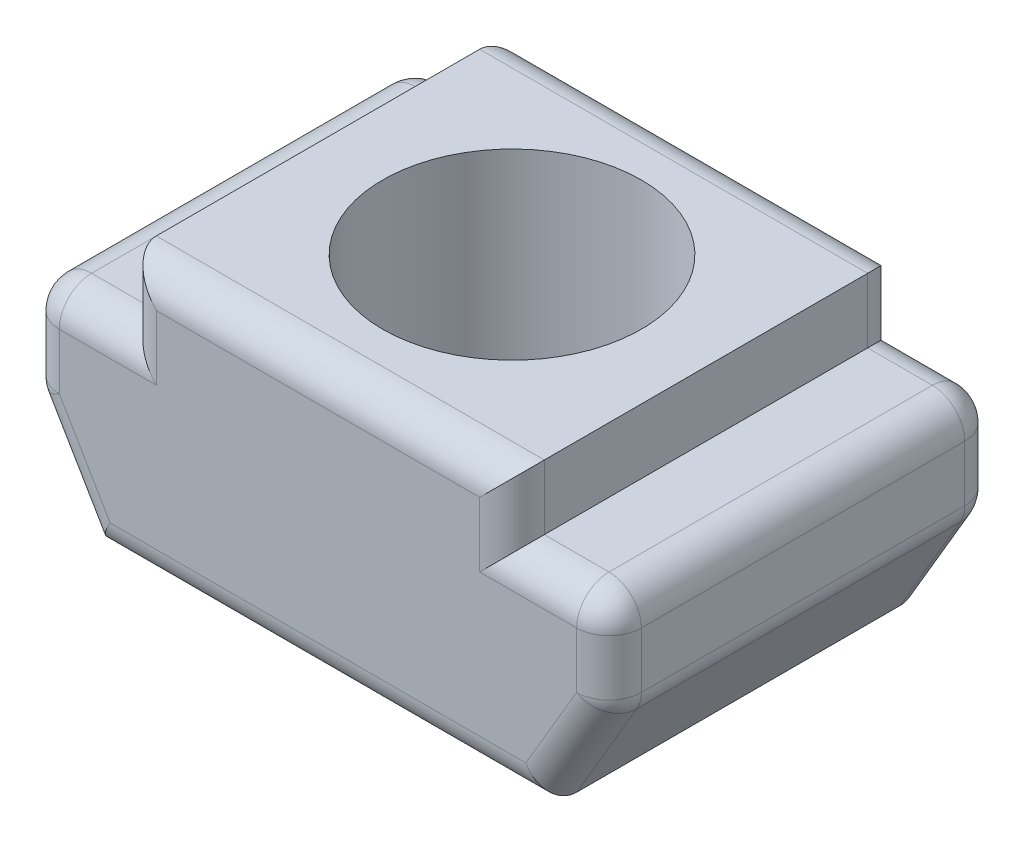
ISO-10303-21;
HEADER;
FILE_DESCRIPTION(('STEP AP214'),'2;1');
FILE_NAME('part.step','',(''),(''),'','','');
FILE_SCHEMA(('AUTOMOTIVE_DESIGN { 1 0 10303 214 1 1 1 1 }'));
ENDSEC;
DATA;
#1=APPLICATION_CONTEXT('core data for automotive mechanical design processes');
#2=APPLICATION_PROTOCOL_DEFINITION('international standard','automotive_design',2000,#1);
#3=PRODUCT_CONTEXT('',#1,'mechanical');
#4=PRODUCT('Part','Part','',(#3));
#5=PRODUCT_RELATED_PRODUCT_CATEGORY('part','',(#4));
#6=PRODUCT_DEFINITION_FORMATION('','',#4);
#7=PRODUCT_DEFINITION_CONTEXT('part definition',#1,'design');
#8=PRODUCT_DEFINITION('design','',#6,#7);
#9=PRODUCT_DEFINITION_SHAPE('','',#8);
#10=(LENGTH_UNIT() NAMED_UNIT(*) SI_UNIT(.MILLI.,.METRE.));
#11=(NAMED_UNIT(*) PLANE_ANGLE_UNIT() SI_UNIT($,.RADIAN.));
#12=(NAMED_UNIT(*) SI_UNIT($,.STERADIAN.) SOLID_ANGLE_UNIT());
#13=UNCERTAINTY_MEASURE_WITH_UNIT(LENGTH_MEASURE(1.E-05),#10,'distance_accuracy_value','');
#14=(GEOMETRIC_REPRESENTATION_CONTEXT(3) GLOBAL_UNCERTAINTY_ASSIGNED_CONTEXT((#13)) GLOBAL_UNIT_ASSIGNED_CONTEXT((#10,
#11,#12)) REPRESENTATION_CONTEXT('',''));
#15=CARTESIAN_POINT('',(0.,0.,0.));
#16=DIRECTION('',(0.,0.,1.));
#17=DIRECTION('',(1.,0.,0.));
#18=AXIS2_PLACEMENT_3D('',#15,#16,#17);
#19=CARTESIAN_POINT('',(0.,0.,6.));
#20=DIRECTION('',(0.,1.,0.));
#21=DIRECTION('',(-1.,0.,0.));
#22=AXIS2_PLACEMENT_3D('',#19,#20,#21);
#23=PLANE('',#22);
#24=DIRECTION('',(0.,0.,-1.));
#25=VECTOR('',#24,1.);
#26=CARTESIAN_POINT('',(4.,0.,6.));
#27=LINE('',#26,#25);
#28=CARTESIAN_POINT('',(4.,0.,5.5));
#29=VERTEX_POINT('',#28);
#30=CARTESIAN_POINT('',(4.,0.,0.5));
#31=VERTEX_POINT('',#30);
#32=EDGE_CURVE('E296',#29,#31,#27,.T.);
#33=ORIENTED_EDGE('',*,*,#32,.T.);
#34=DIRECTION('',(1.,0.,0.));
#35=VECTOR('',#34,1.);
#36=CARTESIAN_POINT('',(3.,0.,0.5));
#37=LINE('',#36,#35);
#38=CARTESIAN_POINT('',(3.,0.,0.5));
#39=VERTEX_POINT('',#38);
#40=EDGE_CURVE('E299',#31,#39,#37,.F.);
#41=ORIENTED_EDGE('',*,*,#40,.T.);
#42=DIRECTION('',(0.,0.,1.));
#43=VECTOR('',#42,1.);
#44=CARTESIAN_POINT('',(3.,0.,0.));
#45=LINE('',#44,#43);
#46=CARTESIAN_POINT('',(3.,0.,5.5));
#47=VERTEX_POINT('',#46);
#48=EDGE_CURVE('E523',#39,#47,#45,.T.);
#49=ORIENTED_EDGE('',*,*,#48,.T.);
#50=DIRECTION('',(1.,0.,0.));
#51=VECTOR('',#50,1.);
#52=CARTESIAN_POINT('',(0.,0.,5.5));
#53=LINE('',#52,#51);
#54=EDGE_CURVE('E293',#47,#29,#53,.T.);
#55=ORIENTED_EDGE('',*,*,#54,.T.);
#56=EDGE_LOOP('',(#33,#41,#49,#55));
#57=FACE_BOUND('',#56,.T.);
#58=ADVANCED_FACE('F41',(#57),#23,.T.);
#59=CARTESIAN_POINT('',(-4.5,0.,6.));
#60=DIRECTION('',(1.,0.,0.));
#61=DIRECTION('',(0.,1.,0.));
#62=AXIS2_PLACEMENT_3D('',#59,#60,#61);
#63=PLANE('',#62);
#64=DIRECTION('',(0.,0.,-1.));
#65=VECTOR('',#64,1.);
#66=CARTESIAN_POINT('',(-4.5,-0.5,0.));
#67=LINE('',#66,#65);
#68=CARTESIAN_POINT('',(-4.5,-0.5,5.5));
#69=VERTEX_POINT('',#68);
#70=CARTESIAN_POINT('',(-4.5,-0.5,0.5));
#71=VERTEX_POINT('',#70);
#72=EDGE_CURVE('E336',#69,#71,#67,.T.);
#73=ORIENTED_EDGE('',*,*,#72,.T.);
#74=DIRECTION('',(0.,-1.,0.));
#75=VECTOR('',#74,1.);
#76=CARTESIAN_POINT('',(-4.5,0.,0.5));
#77=LINE('',#76,#75);
#78=CARTESIAN_POINT('',(-4.5,-1.3638458538342,0.5));
#79=VERTEX_POINT('',#78);
#80=EDGE_CURVE('E340',#71,#79,#77,.T.);
#81=ORIENTED_EDGE('',*,*,#80,.T.);
#82=DIRECTION('',(0.,0.,-1.));
#83=VECTOR('',#82,1.);
#84=CARTESIAN_POINT('',(-4.5,-1.3638458538342,6.));
#85=LINE('',#84,#83);
#86=CARTESIAN_POINT('',(-4.5,-1.3638458538342,5.5));
#87=VERTEX_POINT('',#86);
#88=EDGE_CURVE('E333',#79,#87,#85,.F.);
#89=ORIENTED_EDGE('',*,*,#88,.T.);
#90=DIRECTION('',(0.,-1.,0.));
#91=VECTOR('',#90,1.);
#92=CARTESIAN_POINT('',(-4.5,0.,5.5));
#93=LINE('',#92,#91);
#94=EDGE_CURVE('E330',#87,#69,#93,.F.);
#95=ORIENTED_EDGE('',*,*,#94,.T.);
#96=EDGE_LOOP('',(#73,#81,#89,#95));
#97=FACE_BOUND('',#96,.T.);
#98=ADVANCED_FACE('F585',(#97),#63,.F.);
#99=CARTESIAN_POINT('',(-3.9987146529563,-2.35218508997429,6.));
#100=DIRECTION('',(0.86193421515777,0.507020126563393,0.));
#101=DIRECTION('',(-0.507020126563394,0.86193421515777,0.));
#102=AXIS2_PLACEMENT_3D('',#99,#100,#101);
#103=PLANE('',#102);
#104=DIRECTION('',(0.,0.,-1.));
#105=VECTOR('',#104,1.);
#106=CARTESIAN_POINT('',(-4.43096710757888,-1.6173559171159,6.));
#107=LINE('',#106,#105);
#108=CARTESIAN_POINT('',(-4.43096710757888,-1.6173559171159,5.5));
#109=VERTEX_POINT('',#108);
#110=CARTESIAN_POINT('',(-4.43096710757888,-1.6173559171159,0.5));
#111=VERTEX_POINT('',#110);
#112=EDGE_CURVE('E244',#109,#111,#107,.T.);
#113=ORIENTED_EDGE('',*,*,#112,.T.);
#114=DIRECTION('',(0.507020126563394,-0.86193421515777,0.));
#115=VECTOR('',#114,1.);
#116=CARTESIAN_POINT('',(-3.9987146529563,-2.35218508997429,0.5));
#117=LINE('',#116,#115);
#118=CARTESIAN_POINT('',(-3.5,-3.2,0.5));
#119=VERTEX_POINT('',#118);
#120=EDGE_CURVE('E225',#111,#119,#117,.T.);
#121=ORIENTED_EDGE('',*,*,#120,.T.);
#122=DIRECTION('',(0.,0.,-1.));
#123=VECTOR('',#122,1.);
#124=CARTESIAN_POINT('',(-3.5,-3.2,6.));
#125=LINE('',#124,#123);
#126=CARTESIAN_POINT('',(-3.5,-3.2,5.5));
#127=VERTEX_POINT('',#126);
#128=EDGE_CURVE('E207',#127,#119,#125,.T.);
#129=ORIENTED_EDGE('',*,*,#128,.F.);
#130=DIRECTION('',(0.507020126563394,-0.86193421515777,0.));
#131=VECTOR('',#130,1.);
#132=CARTESIAN_POINT('',(-4.5,-1.5,5.5));
#133=LINE('',#132,#131);
#134=EDGE_CURVE('E222',#127,#109,#133,.F.);
#135=ORIENTED_EDGE('',*,*,#134,.T.);
#136=EDGE_LOOP('',(#113,#121,#129,#135));
#137=FACE_BOUND('',#136,.T.);
#138=ADVANCED_FACE('F220',(#137),#103,.F.);
#139=CARTESIAN_POINT('',(0.,-3.2,6.));
#140=DIRECTION('',(0.,1.,0.));
#141=DIRECTION('',(-1.,0.,0.));
#142=AXIS2_PLACEMENT_3D('',#139,#140,#141);
#143=PLANE('',#142);
#144=CARTESIAN_POINT('',(0.,-3.2,3.));
#145=DIRECTION('',(0.,1.,0.));
#146=DIRECTION('',(0.,0.,1.));
#147=AXIS2_PLACEMENT_3D('',#144,#145,#146);
#148=CIRCLE('',#147,2.);
#149=CARTESIAN_POINT('',(0.,-3.2,5.));
#150=VERTEX_POINT('',#149);
#151=EDGE_CURVE('E517',#150,#150,#148,.T.);
#152=ORIENTED_EDGE('',*,*,#151,.T.);
#153=EDGE_LOOP('',(#152));
#154=FACE_BOUND('',#153,.T.);
#155=ORIENTED_EDGE('',*,*,#128,.T.);
#156=DIRECTION('',(1.,0.,0.));
#157=VECTOR('',#156,1.);
#158=CARTESIAN_POINT('',(0.,-3.2,0.5));
#159=LINE('',#158,#157);
#160=CARTESIAN_POINT('',(3.5,-3.2,0.5));
#161=VERTEX_POINT('',#160);
#162=EDGE_CURVE('E215',#119,#161,#159,.T.);
#163=ORIENTED_EDGE('',*,*,#162,.T.);
#164=DIRECTION('',(0.,0.,-1.));
#165=VECTOR('',#164,1.);
#166=CARTESIAN_POINT('',(3.5,-3.2,6.));
#167=LINE('',#166,#165);
#168=CARTESIAN_POINT('',(3.5,-3.2,5.5));
#169=VERTEX_POINT('',#168);
#170=EDGE_CURVE('E209',#169,#161,#167,.T.);
#171=ORIENTED_EDGE('',*,*,#170,.F.);
#172=DIRECTION('',(1.,0.,0.));
#173=VECTOR('',#172,1.);
#174=CARTESIAN_POINT('',(-3.5,-3.2,5.5));
#175=LINE('',#174,#173);
#176=EDGE_CURVE('E204',#169,#127,#175,.F.);
#177=ORIENTED_EDGE('',*,*,#176,.T.);
#178=EDGE_LOOP('',(#155,#163,#171,#177));
#179=FACE_BOUND('',#178,.T.);
#180=ADVANCED_FACE('F206',(#154,#179),#143,.F.);
#181=CARTESIAN_POINT('',(3.9987146529563,-2.35218508997429,6.));
#182=DIRECTION('',(0.86193421515777,-0.507020126563393,0.));
#183=DIRECTION('',(0.507020126563393,0.86193421515777,0.));
#184=AXIS2_PLACEMENT_3D('',#181,#182,#183);
#185=PLANE('',#184);
#186=ORIENTED_EDGE('',*,*,#170,.T.);
#187=DIRECTION('',(-0.507020126563393,-0.86193421515777,0.));
#188=VECTOR('',#187,1.);
#189=CARTESIAN_POINT('',(4.5,-1.5,0.5));
#190=LINE('',#189,#188);
#191=CARTESIAN_POINT('',(4.43096710757888,-1.6173559171159,0.5));
#192=VERTEX_POINT('',#191);
#193=EDGE_CURVE('E290',#161,#192,#190,.F.);
#194=ORIENTED_EDGE('',*,*,#193,.T.);
#195=DIRECTION('',(0.,0.,-1.));
#196=VECTOR('',#195,1.);
#197=CARTESIAN_POINT('',(4.43096710757888,-1.6173559171159,6.));
#198=LINE('',#197,#196);
#199=CARTESIAN_POINT('',(4.43096710757888,-1.6173559171159,5.5));
#200=VERTEX_POINT('',#199);
#201=EDGE_CURVE('E287',#192,#200,#198,.F.);
#202=ORIENTED_EDGE('',*,*,#201,.T.);
#203=DIRECTION('',(-0.507020126563393,-0.86193421515777,0.));
#204=VECTOR('',#203,1.);
#205=CARTESIAN_POINT('',(3.9987146529563,-2.35218508997429,5.5));
#206=LINE('',#205,#204);
#207=EDGE_CURVE('E284',#200,#169,#206,.T.);
#208=ORIENTED_EDGE('',*,*,#207,.T.);
#209=EDGE_LOOP('',(#186,#194,#202,#208));
#210=FACE_BOUND('',#209,.T.);
#211=ADVANCED_FACE('F543',(#210),#185,.T.);
#212=CARTESIAN_POINT('',(4.5,0.,6.));
#213=DIRECTION('',(1.,0.,0.));
#214=DIRECTION('',(0.,1.,0.));
#215=AXIS2_PLACEMENT_3D('',#212,#213,#214);
#216=PLANE('',#215);
#217=DIRECTION('',(0.,0.,-1.));
#218=VECTOR('',#217,1.);
#219=CARTESIAN_POINT('',(4.5,-1.3638458538342,6.));
#220=LINE('',#219,#218);
#221=CARTESIAN_POINT('',(4.5,-1.3638458538342,5.5));
#222=VERTEX_POINT('',#221);
#223=CARTESIAN_POINT('',(4.5,-1.3638458538342,0.5));
#224=VERTEX_POINT('',#223);
#225=EDGE_CURVE('E349',#222,#224,#220,.T.);
#226=ORIENTED_EDGE('',*,*,#225,.T.);
#227=DIRECTION('',(0.,-1.,0.));
#228=VECTOR('',#227,1.);
#229=CARTESIAN_POINT('',(4.5,0.,0.5));
#230=LINE('',#229,#228);
#231=CARTESIAN_POINT('',(4.5,-0.499999999999999,0.5));
#232=VERTEX_POINT('',#231);
#233=EDGE_CURVE('E353',#224,#232,#230,.F.);
#234=ORIENTED_EDGE('',*,*,#233,.T.);
#235=DIRECTION('',(0.,0.,-1.));
#236=VECTOR('',#235,1.);
#237=CARTESIAN_POINT('',(4.5,-0.499999999999999,6.));
#238=LINE('',#237,#236);
#239=CARTESIAN_POINT('',(4.5,-0.499999999999999,5.5));
#240=VERTEX_POINT('',#239);
#241=EDGE_CURVE('E346',#232,#240,#238,.F.);
#242=ORIENTED_EDGE('',*,*,#241,.T.);
#243=DIRECTION('',(0.,-1.,0.));
#244=VECTOR('',#243,1.);
#245=CARTESIAN_POINT('',(4.5,0.,5.5));
#246=LINE('',#245,#244);
#247=EDGE_CURVE('E343',#240,#222,#246,.T.);
#248=ORIENTED_EDGE('',*,*,#247,.T.);
#249=EDGE_LOOP('',(#226,#234,#242,#248));
#250=FACE_BOUND('',#249,.T.);
#251=ADVANCED_FACE('F626',(#250),#216,.T.);
#252=DIRECTION('',(0.,0.,1.));
#253=VECTOR('',#252,1.);
#254=CARTESIAN_POINT('',(-3.,0.,0.));
#255=LINE('',#254,#253);
#256=CARTESIAN_POINT('',(-3.,0.,0.5));
#257=VERTEX_POINT('',#256);
#258=CARTESIAN_POINT('',(-3.,0.,5.5));
#259=VERTEX_POINT('',#258);
#260=EDGE_CURVE('E526',#257,#259,#255,.T.);
#261=ORIENTED_EDGE('',*,*,#260,.F.);
#262=DIRECTION('',(1.,0.,0.));
#263=VECTOR('',#262,1.);
#264=CARTESIAN_POINT('',(-4.5,0.,0.5));
#265=LINE('',#264,#263);
#266=CARTESIAN_POINT('',(-4.,0.,0.5));
#267=VERTEX_POINT('',#266);
#268=EDGE_CURVE('E327',#257,#267,#265,.F.);
#269=ORIENTED_EDGE('',*,*,#268,.T.);
#270=DIRECTION('',(0.,0.,-1.));
#271=VECTOR('',#270,1.);
#272=CARTESIAN_POINT('',(-4.,0.,6.));
#273=LINE('',#272,#271);
#274=CARTESIAN_POINT('',(-4.,0.,5.5));
#275=VERTEX_POINT('',#274);
#276=EDGE_CURVE('E324',#267,#275,#273,.F.);
#277=ORIENTED_EDGE('',*,*,#276,.T.);
#278=DIRECTION('',(1.,0.,0.));
#279=VECTOR('',#278,1.);
#280=CARTESIAN_POINT('',(0.,0.,5.5));
#281=LINE('',#280,#279);
#282=EDGE_CURVE('E321',#275,#259,#281,.T.);
#283=ORIENTED_EDGE('',*,*,#282,.T.);
#284=EDGE_LOOP('',(#261,#269,#277,#283));
#285=FACE_BOUND('',#284,.T.);
#286=ADVANCED_FACE('F618',(#285),#23,.T.);
#287=CARTESIAN_POINT('',(0.,0.,6.));
#288=DIRECTION('',(0.,0.,1.));
#289=DIRECTION('',(1.,0.,0.));
#290=AXIS2_PLACEMENT_3D('',#287,#288,#289);
#291=PLANE('',#290);
#292=DIRECTION('',(0.,-1.,0.));
#293=VECTOR('',#292,1.);
#294=CARTESIAN_POINT('',(-2.5,0.,6.));
#295=LINE('',#294,#293);
#296=CARTESIAN_POINT('',(-2.5,0.5,6.));
#297=VERTEX_POINT('',#296);
#298=CARTESIAN_POINT('',(-2.5,-0.5,6.));
#299=VERTEX_POINT('',#298);
#300=EDGE_CURVE('E51',#297,#299,#295,.T.);
#301=ORIENTED_EDGE('',*,*,#300,.T.);
#302=DIRECTION('',(1.,0.,0.));
#303=VECTOR('',#302,1.);
#304=CARTESIAN_POINT('',(0.,-0.499999999999999,6.));
#305=LINE('',#304,#303);
#306=CARTESIAN_POINT('',(-4.,-0.5,6.));
#307=VERTEX_POINT('',#306);
#308=EDGE_CURVE('E11',#299,#307,#305,.F.);
#309=ORIENTED_EDGE('',*,*,#308,.T.);
#310=DIRECTION('',(0.,-1.,0.));
#311=VECTOR('',#310,1.);
#312=CARTESIAN_POINT('',(-4.,-1.5,6.));
#313=LINE('',#312,#311);
#314=CARTESIAN_POINT('',(-4.,-1.3638458538342,6.));
#315=VERTEX_POINT('',#314);
#316=EDGE_CURVE('E356',#307,#315,#313,.T.);
#317=ORIENTED_EDGE('',*,*,#316,.T.);
#318=DIRECTION('',(0.507020126563394,-0.86193421515777,0.));
#319=VECTOR('',#318,1.);
#320=CARTESIAN_POINT('',(-3.06903289242111,-2.9464899367183,6.));
#321=LINE('',#320,#319);
#322=CARTESIAN_POINT('',(-3.21402697284365,-2.7,6.));
#323=VERTEX_POINT('',#322);
#324=EDGE_CURVE('E359',#315,#323,#321,.T.);
#325=ORIENTED_EDGE('',*,*,#324,.T.);
#326=DIRECTION('',(1.,0.,0.));
#327=VECTOR('',#326,1.);
#328=CARTESIAN_POINT('',(3.5,-2.7,6.));
#329=LINE('',#328,#327);
#330=CARTESIAN_POINT('',(3.21402697284365,-2.7,6.));
#331=VERTEX_POINT('',#330);
#332=EDGE_CURVE('E232',#323,#331,#329,.T.);
#333=ORIENTED_EDGE('',*,*,#332,.T.);
#334=DIRECTION('',(-0.507020126563393,-0.86193421515777,0.));
#335=VECTOR('',#334,1.);
#336=CARTESIAN_POINT('',(3.56774754537742,-2.09867502669259,6.));
#337=LINE('',#336,#335);
#338=CARTESIAN_POINT('',(4.,-1.3638458538342,6.));
#339=VERTEX_POINT('',#338);
#340=EDGE_CURVE('E364',#331,#339,#337,.F.);
#341=ORIENTED_EDGE('',*,*,#340,.T.);
#342=DIRECTION('',(0.,-1.,0.));
#343=VECTOR('',#342,1.);
#344=CARTESIAN_POINT('',(4.,0.,6.));
#345=LINE('',#344,#343);
#346=CARTESIAN_POINT('',(4.,-0.499999999999999,6.));
#347=VERTEX_POINT('',#346);
#348=EDGE_CURVE('E367',#339,#347,#345,.F.);
#349=ORIENTED_EDGE('',*,*,#348,.T.);
#350=DIRECTION('',(1.,0.,0.));
#351=VECTOR('',#350,1.);
#352=CARTESIAN_POINT('',(0.,-0.499999999999999,6.));
#353=LINE('',#352,#351);
#354=CARTESIAN_POINT('',(2.5,-0.499999999999999,6.));
#355=VERTEX_POINT('',#354);
#356=EDGE_CURVE('E370',#347,#355,#353,.F.);
#357=ORIENTED_EDGE('',*,*,#356,.T.);
#358=DIRECTION('',(0.,-1.,0.));
#359=VECTOR('',#358,1.);
#360=CARTESIAN_POINT('',(2.5,1.,6.));
#361=LINE('',#360,#359);
#362=CARTESIAN_POINT('',(2.5,0.5,6.));
#363=VERTEX_POINT('',#362);
#364=EDGE_CURVE('E373',#355,#363,#361,.F.);
#365=ORIENTED_EDGE('',*,*,#364,.T.);
#366=DIRECTION('',(1.,0.,0.));
#367=VECTOR('',#366,1.);
#368=CARTESIAN_POINT('',(-3.,0.5,6.));
#369=LINE('',#368,#367);
#370=EDGE_CURVE('E62',#363,#297,#369,.F.);
#371=ORIENTED_EDGE('',*,*,#370,.T.);
#372=EDGE_LOOP('',(#301,#309,#317,#325,#333,#341,#349,#357,#365,#371));
#373=FACE_BOUND('',#372,.T.);
#374=ADVANCED_FACE('F600',(#373),#291,.T.);
#375=CARTESIAN_POINT('',(0.,0.,0.));
#376=DIRECTION('',(0.,0.,1.));
#377=DIRECTION('',(1.,0.,0.));
#378=AXIS2_PLACEMENT_3D('',#375,#376,#377);
#379=PLANE('',#378);
#380=DIRECTION('',(1.,0.,0.));
#381=VECTOR('',#380,1.);
#382=CARTESIAN_POINT('',(0.,0.5,0.));
#383=LINE('',#382,#381);
#384=CARTESIAN_POINT('',(-2.5,0.5,0.));
#385=VERTEX_POINT('',#384);
#386=CARTESIAN_POINT('',(2.5,0.5,0.));
#387=VERTEX_POINT('',#386);
#388=EDGE_CURVE('E277',#385,#387,#383,.T.);
#389=ORIENTED_EDGE('',*,*,#388,.T.);
#390=DIRECTION('',(0.,-1.,0.));
#391=VECTOR('',#390,1.);
#392=CARTESIAN_POINT('',(2.5,0.,0.));
#393=LINE('',#392,#391);
#394=CARTESIAN_POINT('',(2.5,-0.499999999999999,0.));
#395=VERTEX_POINT('',#394);
#396=EDGE_CURVE('E216',#387,#395,#393,.T.);
#397=ORIENTED_EDGE('',*,*,#396,.T.);
#398=DIRECTION('',(1.,0.,0.));
#399=VECTOR('',#398,1.);
#400=CARTESIAN_POINT('',(4.5,-0.499999999999999,0.));
#401=LINE('',#400,#399);
#402=CARTESIAN_POINT('',(4.,-0.499999999999999,0.));
#403=VERTEX_POINT('',#402);
#404=EDGE_CURVE('E255',#395,#403,#401,.T.);
#405=ORIENTED_EDGE('',*,*,#404,.T.);
#406=DIRECTION('',(0.,-1.,0.));
#407=VECTOR('',#406,1.);
#408=CARTESIAN_POINT('',(4.,-1.5,0.));
#409=LINE('',#408,#407);
#410=CARTESIAN_POINT('',(4.,-1.3638458538342,0.));
#411=VERTEX_POINT('',#410);
#412=EDGE_CURVE('E252',#403,#411,#409,.T.);
#413=ORIENTED_EDGE('',*,*,#412,.T.);
#414=DIRECTION('',(-0.507020126563393,-0.86193421515777,0.));
#415=VECTOR('',#414,1.);
#416=CARTESIAN_POINT('',(3.06903289242112,-2.9464899367183,0.));
#417=LINE('',#416,#415);
#418=CARTESIAN_POINT('',(3.21402697284365,-2.7,0.));
#419=VERTEX_POINT('',#418);
#420=EDGE_CURVE('E258',#411,#419,#417,.T.);
#421=ORIENTED_EDGE('',*,*,#420,.T.);
#422=DIRECTION('',(1.,0.,0.));
#423=VECTOR('',#422,1.);
#424=CARTESIAN_POINT('',(0.,-2.7,0.));
#425=LINE('',#424,#423);
#426=CARTESIAN_POINT('',(-3.21402697284365,-2.7,0.));
#427=VERTEX_POINT('',#426);
#428=EDGE_CURVE('E261',#419,#427,#425,.F.);
#429=ORIENTED_EDGE('',*,*,#428,.T.);
#430=DIRECTION('',(0.507020126563394,-0.86193421515777,0.));
#431=VECTOR('',#430,1.);
#432=CARTESIAN_POINT('',(-3.56774754537741,-2.09867502669259,0.));
#433=LINE('',#432,#431);
#434=CARTESIAN_POINT('',(-4.,-1.3638458538342,0.));
#435=VERTEX_POINT('',#434);
#436=EDGE_CURVE('E264',#427,#435,#433,.F.);
#437=ORIENTED_EDGE('',*,*,#436,.T.);
#438=DIRECTION('',(0.,-1.,0.));
#439=VECTOR('',#438,1.);
#440=CARTESIAN_POINT('',(-4.,0.,0.));
#441=LINE('',#440,#439);
#442=CARTESIAN_POINT('',(-4.,-0.5,0.));
#443=VERTEX_POINT('',#442);
#444=EDGE_CURVE('E268',#435,#443,#441,.F.);
#445=ORIENTED_EDGE('',*,*,#444,.T.);
#446=DIRECTION('',(1.,0.,0.));
#447=VECTOR('',#446,1.);
#448=CARTESIAN_POINT('',(-3.,-0.5,0.));
#449=LINE('',#448,#447);
#450=CARTESIAN_POINT('',(-2.5,-0.5,0.));
#451=VERTEX_POINT('',#450);
#452=EDGE_CURVE('E271',#443,#451,#449,.T.);
#453=ORIENTED_EDGE('',*,*,#452,.T.);
#454=DIRECTION('',(0.,-1.,0.));
#455=VECTOR('',#454,1.);
#456=CARTESIAN_POINT('',(-2.5,1.,0.));
#457=LINE('',#456,#455);
#458=EDGE_CURVE('E274',#451,#385,#457,.F.);
#459=ORIENTED_EDGE('',*,*,#458,.T.);
#460=EDGE_LOOP('',(#389,#397,#405,#413,#421,#429,#437,#445,#453,#459));
#461=FACE_BOUND('',#460,.T.);
#462=ADVANCED_FACE('F558',(#461),#379,.F.);
#463=CARTESIAN_POINT('',(-3.,1.,0.));
#464=DIRECTION('',(-1.,0.,0.));
#465=DIRECTION('',(0.,-1.,0.));
#466=AXIS2_PLACEMENT_3D('',#463,#464,#465);
#467=PLANE('',#466);
#468=DIRECTION('',(0.,0.,1.));
#469=VECTOR('',#468,1.);
#470=CARTESIAN_POINT('',(-3.,1.,0.));
#471=LINE('',#470,#469);
#472=CARTESIAN_POINT('',(-3.,1.,0.5));
#473=VERTEX_POINT('',#472);
#474=CARTESIAN_POINT('',(-3.,1.,5.5));
#475=VERTEX_POINT('',#474);
#476=EDGE_CURVE('E530',#473,#475,#471,.T.);
#477=ORIENTED_EDGE('',*,*,#476,.F.);
#478=DIRECTION('',(0.,-1.,0.));
#479=VECTOR('',#478,1.);
#480=CARTESIAN_POINT('',(-3.,0.,0.5));
#481=LINE('',#480,#479);
#482=EDGE_CURVE('E318',#473,#257,#481,.T.);
#483=ORIENTED_EDGE('',*,*,#482,.T.);
#484=ORIENTED_EDGE('',*,*,#260,.T.);
#485=DIRECTION('',(0.,-1.,0.));
#486=VECTOR('',#485,1.);
#487=CARTESIAN_POINT('',(-3.,1.,5.5));
#488=LINE('',#487,#486);
#489=EDGE_CURVE('E315',#259,#475,#488,.F.);
#490=ORIENTED_EDGE('',*,*,#489,.T.);
#491=EDGE_LOOP('',(#477,#483,#484,#490));
#492=FACE_BOUND('',#491,.T.);
#493=ADVANCED_FACE('F701',(#492),#467,.T.);
#494=CARTESIAN_POINT('',(-3.,1.,0.));
#495=DIRECTION('',(0.,-1.,0.));
#496=DIRECTION('',(0.,0.,-1.));
#497=AXIS2_PLACEMENT_3D('',#494,#495,#496);
#498=PLANE('',#497);
#499=CARTESIAN_POINT('',(0.,1.,3.));
#500=DIRECTION('',(0.,1.,0.));
#501=DIRECTION('',(0.,0.,1.));
#502=AXIS2_PLACEMENT_3D('',#499,#500,#501);
#503=CIRCLE('',#502,2.);
#504=CARTESIAN_POINT('',(0.,1.,5.));
#505=VERTEX_POINT('',#504);
#506=EDGE_CURVE('E511',#505,#505,#503,.T.);
#507=ORIENTED_EDGE('',*,*,#506,.F.);
#508=EDGE_LOOP('',(#507));
#509=FACE_BOUND('',#508,.T.);
#510=DIRECTION('',(0.,0.,1.));
#511=VECTOR('',#510,1.);
#512=CARTESIAN_POINT('',(3.,1.,0.));
#513=LINE('',#512,#511);
#514=CARTESIAN_POINT('',(3.,1.,0.5));
#515=VERTEX_POINT('',#514);
#516=CARTESIAN_POINT('',(3.,1.,5.5));
#517=VERTEX_POINT('',#516);
#518=EDGE_CURVE('E534',#515,#517,#513,.T.);
#519=ORIENTED_EDGE('',*,*,#518,.F.);
#520=DIRECTION('',(1.,0.,0.));
#521=VECTOR('',#520,1.);
#522=CARTESIAN_POINT('',(-3.,1.,0.5));
#523=LINE('',#522,#521);
#524=EDGE_CURVE('E312',#515,#473,#523,.F.);
#525=ORIENTED_EDGE('',*,*,#524,.T.);
#526=ORIENTED_EDGE('',*,*,#476,.T.);
#527=DIRECTION('',(1.,0.,0.));
#528=VECTOR('',#527,1.);
#529=CARTESIAN_POINT('',(3.,1.,5.5));
#530=LINE('',#529,#528);
#531=EDGE_CURVE('E309',#475,#517,#530,.T.);
#532=ORIENTED_EDGE('',*,*,#531,.T.);
#533=EDGE_LOOP('',(#519,#525,#526,#532));
#534=FACE_BOUND('',#533,.T.);
#535=ADVANCED_FACE('F704',(#509,#534),#498,.F.);
#536=CARTESIAN_POINT('',(3.,1.,0.));
#537=DIRECTION('',(-1.,0.,0.));
#538=DIRECTION('',(0.,0.,1.));
#539=AXIS2_PLACEMENT_3D('',#536,#537,#538);
#540=PLANE('',#539);
#541=ORIENTED_EDGE('',*,*,#48,.F.);
#542=DIRECTION('',(0.,-1.,0.));
#543=VECTOR('',#542,1.);
#544=CARTESIAN_POINT('',(3.,1.,0.5));
#545=LINE('',#544,#543);
#546=EDGE_CURVE('E306',#39,#515,#545,.F.);
#547=ORIENTED_EDGE('',*,*,#546,.T.);
#548=ORIENTED_EDGE('',*,*,#518,.T.);
#549=DIRECTION('',(0.,-1.,0.));
#550=VECTOR('',#549,1.);
#551=CARTESIAN_POINT('',(3.,0.,5.5));
#552=LINE('',#551,#550);
#553=EDGE_CURVE('E303',#517,#47,#552,.T.);
#554=ORIENTED_EDGE('',*,*,#553,.T.);
#555=EDGE_LOOP('',(#541,#547,#548,#554));
#556=FACE_BOUND('',#555,.T.);
#557=ADVANCED_FACE('F705',(#556),#540,.F.);
#558=CARTESIAN_POINT('',(0.,-3.2,3.));
#559=DIRECTION('',(0.,1.,0.));
#560=DIRECTION('',(0.,0.,1.));
#561=AXIS2_PLACEMENT_3D('',#558,#559,#560);
#562=CYLINDRICAL_SURFACE('',#561,2.);
#563=ORIENTED_EDGE('',*,*,#151,.F.);
#564=EDGE_LOOP('',(#563));
#565=FACE_BOUND('',#564,.T.);
#566=ORIENTED_EDGE('',*,*,#506,.T.);
#567=EDGE_LOOP('',(#566));
#568=FACE_BOUND('',#567,.T.);
#569=ADVANCED_FACE('F707',(#565,#568),#562,.F.);
#570=CARTESIAN_POINT('',(2.5,1.,5.5));
#571=DIRECTION('',(0.,1.,0.));
#572=DIRECTION('',(0.,0.,1.));
#573=AXIS2_PLACEMENT_3D('',#570,#571,#572);
#574=CYLINDRICAL_SURFACE('',#573,0.5);
#575=CARTESIAN_POINT('',(2.5,-0.499999999999999,5.5));
#576=DIRECTION('',(-0.707106781186548,0.707106781186547,0.));
#577=DIRECTION('',(0.707106781186547,0.707106781186548,0.));
#578=AXIS2_PLACEMENT_3D('',#575,#576,#577);
#579=ELLIPSE('',#578,0.707106781186548,0.5);
#580=EDGE_CURVE('E502',#47,#355,#579,.F.);
#581=ORIENTED_EDGE('',*,*,#580,.F.);
#582=ORIENTED_EDGE('',*,*,#553,.F.);
#583=CARTESIAN_POINT('',(2.5,0.5,5.5));
#584=DIRECTION('',(-0.707106781186547,0.707106781186547,0.));
#585=DIRECTION('',(0.707106781186547,0.707106781186547,0.));
#586=AXIS2_PLACEMENT_3D('',#583,#584,#585);
#587=ELLIPSE('',#586,0.707106781186547,0.5);
#588=EDGE_CURVE('E45',#363,#517,#587,.T.);
#589=ORIENTED_EDGE('',*,*,#588,.F.);
#590=ORIENTED_EDGE('',*,*,#364,.F.);
#591=EDGE_LOOP('',(#581,#582,#589,#590));
#592=FACE_BOUND('',#591,.T.);
#593=ADVANCED_FACE('F43',(#592),#574,.T.);
#594=CARTESIAN_POINT('',(-3.,0.5,5.5));
#595=DIRECTION('',(-1.,0.,0.));
#596=DIRECTION('',(0.,0.,1.));
#597=AXIS2_PLACEMENT_3D('',#594,#595,#596);
#598=CYLINDRICAL_SURFACE('',#597,0.5);
#599=ORIENTED_EDGE('',*,*,#588,.T.);
#600=ORIENTED_EDGE('',*,*,#531,.F.);
#601=CARTESIAN_POINT('',(-2.5,0.5,5.5));
#602=DIRECTION('',(-0.707106781186548,-0.707106781186547,0.));
#603=DIRECTION('',(-0.707106781186547,0.707106781186548,0.));
#604=AXIS2_PLACEMENT_3D('',#601,#602,#603);
#605=ELLIPSE('',#604,0.707106781186547,0.5);
#606=EDGE_CURVE('E499',#297,#475,#605,.T.);
#607=ORIENTED_EDGE('',*,*,#606,.F.);
#608=ORIENTED_EDGE('',*,*,#370,.F.);
#609=EDGE_LOOP('',(#599,#600,#607,#608));
#610=FACE_BOUND('',#609,.T.);
#611=ADVANCED_FACE('F697',(#610),#598,.T.);
#612=CARTESIAN_POINT('',(0.,-0.499999999999999,5.5));
#613=DIRECTION('',(1.,0.,0.));
#614=DIRECTION('',(0.,1.,0.));
#615=AXIS2_PLACEMENT_3D('',#612,#613,#614);
#616=CYLINDRICAL_SURFACE('',#615,0.5);
#617=ORIENTED_EDGE('',*,*,#580,.T.);
#618=ORIENTED_EDGE('',*,*,#356,.F.);
#619=CARTESIAN_POINT('',(4.,-0.499999999999999,5.5));
#620=DIRECTION('',(1.,0.,0.));
#621=DIRECTION('',(0.,0.,-1.));
#622=AXIS2_PLACEMENT_3D('',#619,#620,#621);
#623=CIRCLE('',#622,0.5);
#624=EDGE_CURVE('E495',#29,#347,#623,.T.);
#625=ORIENTED_EDGE('',*,*,#624,.F.);
#626=ORIENTED_EDGE('',*,*,#54,.F.);
#627=EDGE_LOOP('',(#617,#618,#625,#626));
#628=FACE_BOUND('',#627,.T.);
#629=ADVANCED_FACE('F685',(#628),#616,.T.);
#630=CARTESIAN_POINT('',(-2.5,0.,5.5));
#631=DIRECTION('',(0.,-1.,0.));
#632=DIRECTION('',(1.,0.,0.));
#633=AXIS2_PLACEMENT_3D('',#630,#631,#632);
#634=CYLINDRICAL_SURFACE('',#633,0.5);
#635=ORIENTED_EDGE('',*,*,#606,.T.);
#636=ORIENTED_EDGE('',*,*,#489,.F.);
#637=CARTESIAN_POINT('',(-2.5,-0.5,5.5));
#638=DIRECTION('',(0.707106781186548,0.707106781186547,0.));
#639=DIRECTION('',(0.707106781186547,-0.707106781186548,0.));
#640=AXIS2_PLACEMENT_3D('',#637,#638,#639);
#641=ELLIPSE('',#640,0.707106781186547,0.5);
#642=EDGE_CURVE('E487',#299,#259,#641,.F.);
#643=ORIENTED_EDGE('',*,*,#642,.F.);
#644=ORIENTED_EDGE('',*,*,#300,.F.);
#645=EDGE_LOOP('',(#635,#636,#643,#644));
#646=FACE_BOUND('',#645,.T.);
#647=ADVANCED_FACE('F699',(#646),#634,.T.);
#648=CARTESIAN_POINT('',(4.,-0.499999999999999,5.5));
#649=DIRECTION('',(0.,0.,1.));
#650=DIRECTION('',(1.,0.,0.));
#651=AXIS2_PLACEMENT_3D('',#648,#649,#650);
#652=SPHERICAL_SURFACE('',#651,0.5);
#653=CARTESIAN_POINT('',(4.,-0.499999999999999,5.5));
#654=DIRECTION('',(0.,0.,1.));
#655=DIRECTION('',(1.,0.,0.));
#656=AXIS2_PLACEMENT_3D('',#653,#654,#655);
#657=CIRCLE('',#656,0.5);
#658=EDGE_CURVE('E479',#29,#240,#657,.F.);
#659=ORIENTED_EDGE('',*,*,#658,.F.);
#660=ORIENTED_EDGE('',*,*,#624,.T.);
#661=CARTESIAN_POINT('',(4.,-0.499999999999999,5.5));
#662=DIRECTION('',(0.,1.,0.));
#663=DIRECTION('',(-1.,0.,0.));
#664=AXIS2_PLACEMENT_3D('',#661,#662,#663);
#665=CIRCLE('',#664,0.5);
#666=EDGE_CURVE('E483',#240,#347,#665,.F.);
#667=ORIENTED_EDGE('',*,*,#666,.F.);
#668=EDGE_LOOP('',(#659,#660,#667));
#669=FACE_BOUND('',#668,.T.);
#670=ADVANCED_FACE('F688',(#669),#652,.T.);
#671=CARTESIAN_POINT('',(2.5,0.,0.5));
#672=DIRECTION('',(0.,-1.,0.));
#673=DIRECTION('',(0.,0.,-1.));
#674=AXIS2_PLACEMENT_3D('',#671,#672,#673);
#675=CYLINDRICAL_SURFACE('',#674,0.5);
#676=CARTESIAN_POINT('',(2.5,-0.499999999999999,0.5));
#677=DIRECTION('',(-0.707106781186548,0.707106781186547,0.));
#678=DIRECTION('',(-0.707106781186547,-0.707106781186548,0.));
#679=AXIS2_PLACEMENT_3D('',#676,#677,#678);
#680=ELLIPSE('',#679,0.707106781186548,0.5);
#681=EDGE_CURVE('E476',#395,#39,#680,.F.);
#682=ORIENTED_EDGE('',*,*,#681,.F.);
#683=ORIENTED_EDGE('',*,*,#396,.F.);
#684=CARTESIAN_POINT('',(2.5,0.5,0.5));
#685=DIRECTION('',(0.707106781186547,-0.707106781186547,0.));
#686=DIRECTION('',(0.707106781186547,0.707106781186547,0.));
#687=AXIS2_PLACEMENT_3D('',#684,#685,#686);
#688=ELLIPSE('',#687,0.707106781186547,0.5);
#689=EDGE_CURVE('E491',#515,#387,#688,.F.);
#690=ORIENTED_EDGE('',*,*,#689,.F.);
#691=ORIENTED_EDGE('',*,*,#546,.F.);
#692=EDGE_LOOP('',(#682,#683,#690,#691));
#693=FACE_BOUND('',#692,.T.);
#694=ADVANCED_FACE('F650',(#693),#675,.T.);
#695=CARTESIAN_POINT('',(0.,0.5,0.5));
#696=DIRECTION('',(1.,0.,0.));
#697=DIRECTION('',(0.,0.,-1.));
#698=AXIS2_PLACEMENT_3D('',#695,#696,#697);
#699=CYLINDRICAL_SURFACE('',#698,0.5);
#700=ORIENTED_EDGE('',*,*,#689,.T.);
#701=ORIENTED_EDGE('',*,*,#388,.F.);
#702=CARTESIAN_POINT('',(-2.5,0.5,0.5));
#703=DIRECTION('',(0.707106781186548,0.707106781186547,0.));
#704=DIRECTION('',(-0.707106781186547,0.707106781186548,0.));
#705=AXIS2_PLACEMENT_3D('',#702,#703,#704);
#706=ELLIPSE('',#705,0.707106781186547,0.5);
#707=EDGE_CURVE('E472',#473,#385,#706,.F.);
#708=ORIENTED_EDGE('',*,*,#707,.F.);
#709=ORIENTED_EDGE('',*,*,#524,.F.);
#710=EDGE_LOOP('',(#700,#701,#708,#709));
#711=FACE_BOUND('',#710,.T.);
#712=ADVANCED_FACE('F644',(#711),#699,.T.);
#713=CARTESIAN_POINT('',(0.,-0.499999999999999,5.5));
#714=DIRECTION('',(1.,0.,0.));
#715=DIRECTION('',(0.,1.,0.));
#716=AXIS2_PLACEMENT_3D('',#713,#714,#715);
#717=CYLINDRICAL_SURFACE('',#716,0.5);
#718=ORIENTED_EDGE('',*,*,#642,.T.);
#719=ORIENTED_EDGE('',*,*,#282,.F.);
#720=CARTESIAN_POINT('',(-4.,-0.5,5.5));
#721=DIRECTION('',(-1.,0.,0.));
#722=DIRECTION('',(0.,0.,1.));
#723=AXIS2_PLACEMENT_3D('',#720,#721,#722);
#724=CIRCLE('',#723,0.5);
#725=EDGE_CURVE('E468',#307,#275,#724,.T.);
#726=ORIENTED_EDGE('',*,*,#725,.F.);
#727=ORIENTED_EDGE('',*,*,#308,.F.);
#728=EDGE_LOOP('',(#718,#719,#726,#727));
#729=FACE_BOUND('',#728,.T.);
#730=ADVANCED_FACE('F599',(#729),#717,.T.);
#731=CARTESIAN_POINT('',(3.56774754537741,-2.09867502669259,5.5));
#732=DIRECTION('',(-0.507020126563393,-0.86193421515777,0.));
#733=DIRECTION('',(0.86193421515777,-0.507020126563393,0.));
#734=AXIS2_PLACEMENT_3D('',#731,#732,#733);
#735=CYLINDRICAL_SURFACE('',#734,0.5);
#736=CARTESIAN_POINT('',(4.,-1.3638458538342,5.5));
#737=DIRECTION('',(0.507020126563393,0.86193421515777,0.));
#738=DIRECTION('',(-0.86193421515777,0.507020126563393,0.));
#739=AXIS2_PLACEMENT_3D('',#736,#737,#738);
#740=CIRCLE('',#739,0.5);
#741=EDGE_CURVE('E461',#339,#200,#740,.T.);
#742=ORIENTED_EDGE('',*,*,#741,.F.);
#743=ORIENTED_EDGE('',*,*,#340,.F.);
#744=CARTESIAN_POINT('',(3.21402697284365,-2.7,5.5));
#745=DIRECTION('',(-0.868049574207428,-0.496477528915764,0.));
#746=DIRECTION('',(-0.496477528915764,0.868049574207428,0.));
#747=AXIS2_PLACEMENT_3D('',#744,#745,#746);
#748=ELLIPSE('',#747,0.576003968962861,0.5);
#749=EDGE_CURVE('E465',#169,#331,#748,.T.);
#750=ORIENTED_EDGE('',*,*,#749,.F.);
#751=ORIENTED_EDGE('',*,*,#207,.F.);
#752=EDGE_LOOP('',(#742,#743,#750,#751));
#753=FACE_BOUND('',#752,.T.);
#754=ADVANCED_FACE('F673',(#753),#735,.T.);
#755=CARTESIAN_POINT('',(4.,0.,5.5));
#756=DIRECTION('',(0.,-1.,0.));
#757=DIRECTION('',(1.,0.,0.));
#758=AXIS2_PLACEMENT_3D('',#755,#756,#757);
#759=CYLINDRICAL_SURFACE('',#758,0.5);
#760=ORIENTED_EDGE('',*,*,#666,.T.);
#761=ORIENTED_EDGE('',*,*,#348,.F.);
#762=CARTESIAN_POINT('',(4.,-1.3638458538342,5.5));
#763=DIRECTION('',(0.,-1.,0.));
#764=DIRECTION('',(1.,0.,0.));
#765=AXIS2_PLACEMENT_3D('',#762,#763,#764);
#766=CIRCLE('',#765,0.5);
#767=EDGE_CURVE('E457',#222,#339,#766,.T.);
#768=ORIENTED_EDGE('',*,*,#767,.F.);
#769=ORIENTED_EDGE('',*,*,#247,.F.);
#770=EDGE_LOOP('',(#760,#761,#768,#769));
#771=FACE_BOUND('',#770,.T.);
#772=ADVANCED_FACE('F681',(#771),#759,.T.);
#773=CARTESIAN_POINT('',(4.,-0.499999999999999,6.));
#774=DIRECTION('',(0.,0.,-1.));
#775=DIRECTION('',(-1.,0.,0.));
#776=AXIS2_PLACEMENT_3D('',#773,#774,#775);
#777=CYLINDRICAL_SURFACE('',#776,0.5);
#778=ORIENTED_EDGE('',*,*,#658,.T.);
#779=ORIENTED_EDGE('',*,*,#241,.F.);
#780=CARTESIAN_POINT('',(4.,-0.499999999999999,0.5));
#781=DIRECTION('',(0.,0.,-1.));
#782=DIRECTION('',(-1.,0.,0.));
#783=AXIS2_PLACEMENT_3D('',#780,#781,#782);
#784=CIRCLE('',#783,0.5);
#785=EDGE_CURVE('E453',#31,#232,#784,.T.);
#786=ORIENTED_EDGE('',*,*,#785,.F.);
#787=ORIENTED_EDGE('',*,*,#32,.F.);
#788=EDGE_LOOP('',(#778,#779,#786,#787));
#789=FACE_BOUND('',#788,.T.);
#790=ADVANCED_FACE('F692',(#789),#777,.T.);
#791=CARTESIAN_POINT('',(0.,-0.499999999999999,0.5));
#792=DIRECTION('',(-1.,0.,0.));
#793=DIRECTION('',(0.,-1.,0.));
#794=AXIS2_PLACEMENT_3D('',#791,#792,#793);
#795=CYLINDRICAL_SURFACE('',#794,0.5);
#796=ORIENTED_EDGE('',*,*,#681,.T.);
#797=ORIENTED_EDGE('',*,*,#40,.F.);
#798=CARTESIAN_POINT('',(4.,-0.499999999999999,0.5));
#799=DIRECTION('',(1.,0.,0.));
#800=DIRECTION('',(0.,0.,-1.));
#801=AXIS2_PLACEMENT_3D('',#798,#799,#800);
#802=CIRCLE('',#801,0.5);
#803=EDGE_CURVE('E449',#403,#31,#802,.T.);
#804=ORIENTED_EDGE('',*,*,#803,.F.);
#805=ORIENTED_EDGE('',*,*,#404,.F.);
#806=EDGE_LOOP('',(#796,#797,#804,#805));
#807=FACE_BOUND('',#806,.T.);
#808=ADVANCED_FACE('F658',(#807),#795,.T.);
#809=CARTESIAN_POINT('',(-2.5,1.,0.5));
#810=DIRECTION('',(0.,1.,0.));
#811=DIRECTION('',(-1.,0.,0.));
#812=AXIS2_PLACEMENT_3D('',#809,#810,#811);
#813=CYLINDRICAL_SURFACE('',#812,0.5);
#814=ORIENTED_EDGE('',*,*,#707,.T.);
#815=ORIENTED_EDGE('',*,*,#458,.F.);
#816=CARTESIAN_POINT('',(-2.5,-0.5,0.5));
#817=DIRECTION('',(0.707106781186548,0.707106781186547,0.));
#818=DIRECTION('',(-0.707106781186547,0.707106781186548,0.));
#819=AXIS2_PLACEMENT_3D('',#816,#817,#818);
#820=ELLIPSE('',#819,0.707106781186547,0.5);
#821=EDGE_CURVE('E445',#257,#451,#820,.F.);
#822=ORIENTED_EDGE('',*,*,#821,.F.);
#823=ORIENTED_EDGE('',*,*,#482,.F.);
#824=EDGE_LOOP('',(#814,#815,#822,#823));
#825=FACE_BOUND('',#824,.T.);
#826=ADVANCED_FACE('F639',(#825),#813,.T.);
#827=CARTESIAN_POINT('',(-4.,-0.5,5.5));
#828=DIRECTION('',(0.,0.,1.));
#829=DIRECTION('',(1.,0.,0.));
#830=AXIS2_PLACEMENT_3D('',#827,#828,#829);
#831=SPHERICAL_SURFACE('',#830,0.5);
#832=CARTESIAN_POINT('',(-4.,-0.5,5.5));
#833=DIRECTION('',(0.,1.,0.));
#834=DIRECTION('',(-1.,0.,0.));
#835=AXIS2_PLACEMENT_3D('',#832,#833,#834);
#836=CIRCLE('',#835,0.5);
#837=EDGE_CURVE('E236',#307,#69,#836,.F.);
#838=ORIENTED_EDGE('',*,*,#837,.F.);
#839=ORIENTED_EDGE('',*,*,#725,.T.);
#840=CARTESIAN_POINT('',(-4.,-0.5,5.5));
#841=DIRECTION('',(0.,0.,1.));
#842=DIRECTION('',(1.,0.,0.));
#843=AXIS2_PLACEMENT_3D('',#840,#841,#842);
#844=CIRCLE('',#843,0.5);
#845=EDGE_CURVE('E441',#69,#275,#844,.F.);
#846=ORIENTED_EDGE('',*,*,#845,.F.);
#847=EDGE_LOOP('',(#838,#839,#846));
#848=FACE_BOUND('',#847,.T.);
#849=ADVANCED_FACE('F595',(#848),#831,.T.);
#850=CARTESIAN_POINT('',(0.,-2.7,5.5));
#851=DIRECTION('',(-1.,0.,0.));
#852=DIRECTION('',(0.,-1.,0.));
#853=AXIS2_PLACEMENT_3D('',#850,#851,#852);
#854=CYLINDRICAL_SURFACE('',#853,0.5);
#855=ORIENTED_EDGE('',*,*,#749,.T.);
#856=ORIENTED_EDGE('',*,*,#332,.F.);
#857=CARTESIAN_POINT('',(-3.21402697284365,-2.7,5.5));
#858=DIRECTION('',(-0.868049574207428,0.496477528915764,0.));
#859=DIRECTION('',(0.496477528915764,0.868049574207428,0.));
#860=AXIS2_PLACEMENT_3D('',#857,#858,#859);
#861=ELLIPSE('',#860,0.576003968962861,0.5);
#862=EDGE_CURVE('E230',#127,#323,#861,.T.);
#863=ORIENTED_EDGE('',*,*,#862,.F.);
#864=ORIENTED_EDGE('',*,*,#176,.F.);
#865=EDGE_LOOP('',(#855,#856,#863,#864));
#866=FACE_BOUND('',#865,.T.);
#867=ADVANCED_FACE('F231',(#866),#854,.T.);
#868=CARTESIAN_POINT('',(4.,-1.3638458538342,5.5));
#869=DIRECTION('',(0.,0.,1.));
#870=DIRECTION('',(1.,0.,0.));
#871=AXIS2_PLACEMENT_3D('',#868,#869,#870);
#872=SPHERICAL_SURFACE('',#871,0.5);
#873=ORIENTED_EDGE('',*,*,#767,.T.);
#874=ORIENTED_EDGE('',*,*,#741,.T.);
#875=CARTESIAN_POINT('',(4.,-1.3638458538342,5.5));
#876=DIRECTION('',(0.,0.,1.));
#877=DIRECTION('',(1.,0.,0.));
#878=AXIS2_PLACEMENT_3D('',#875,#876,#877);
#879=CIRCLE('',#878,0.5);
#880=EDGE_CURVE('E237',#222,#200,#879,.F.);
#881=ORIENTED_EDGE('',*,*,#880,.F.);
#882=EDGE_LOOP('',(#873,#874,#881));
#883=FACE_BOUND('',#882,.T.);
#884=ADVANCED_FACE('F676',(#883),#872,.T.);
#885=CARTESIAN_POINT('',(4.,-0.499999999999999,0.5));
#886=DIRECTION('',(0.,0.,1.));
#887=DIRECTION('',(1.,0.,0.));
#888=AXIS2_PLACEMENT_3D('',#885,#886,#887);
#889=SPHERICAL_SURFACE('',#888,0.5);
#890=ORIENTED_EDGE('',*,*,#803,.T.);
#891=ORIENTED_EDGE('',*,*,#785,.T.);
#892=CARTESIAN_POINT('',(4.,-0.499999999999999,0.5));
#893=DIRECTION('',(0.,1.,0.));
#894=DIRECTION('',(-1.,0.,0.));
#895=AXIS2_PLACEMENT_3D('',#892,#893,#894);
#896=CIRCLE('',#895,0.5);
#897=EDGE_CURVE('E431',#403,#232,#896,.F.);
#898=ORIENTED_EDGE('',*,*,#897,.F.);
#899=EDGE_LOOP('',(#890,#891,#898));
#900=FACE_BOUND('',#899,.T.);
#901=ADVANCED_FACE('F661',(#900),#889,.T.);
#902=CARTESIAN_POINT('',(0.,-0.499999999999999,0.5));
#903=DIRECTION('',(-1.,0.,0.));
#904=DIRECTION('',(0.,-1.,0.));
#905=AXIS2_PLACEMENT_3D('',#902,#903,#904);
#906=CYLINDRICAL_SURFACE('',#905,0.5);
#907=ORIENTED_EDGE('',*,*,#821,.T.);
#908=ORIENTED_EDGE('',*,*,#452,.F.);
#909=CARTESIAN_POINT('',(-4.,-0.5,0.5));
#910=DIRECTION('',(-1.,0.,0.));
#911=DIRECTION('',(0.,0.,1.));
#912=AXIS2_PLACEMENT_3D('',#909,#910,#911);
#913=CIRCLE('',#912,0.5);
#914=EDGE_CURVE('E427',#267,#443,#913,.T.);
#915=ORIENTED_EDGE('',*,*,#914,.F.);
#916=ORIENTED_EDGE('',*,*,#268,.F.);
#917=EDGE_LOOP('',(#907,#908,#915,#916));
#918=FACE_BOUND('',#917,.T.);
#919=ADVANCED_FACE('F574',(#918),#906,.T.);
#920=CARTESIAN_POINT('',(-4.,-0.5,6.));
#921=DIRECTION('',(0.,0.,1.));
#922=DIRECTION('',(1.,0.,0.));
#923=AXIS2_PLACEMENT_3D('',#920,#921,#922);
#924=CYLINDRICAL_SURFACE('',#923,0.5);
#925=ORIENTED_EDGE('',*,*,#845,.T.);
#926=ORIENTED_EDGE('',*,*,#276,.F.);
#927=CARTESIAN_POINT('',(-4.,-0.5,0.5));
#928=DIRECTION('',(0.,0.,-1.));
#929=DIRECTION('',(0.,1.,0.));
#930=AXIS2_PLACEMENT_3D('',#927,#928,#929);
#931=CIRCLE('',#930,0.5);
#932=EDGE_CURVE('E423',#71,#267,#931,.T.);
#933=ORIENTED_EDGE('',*,*,#932,.F.);
#934=ORIENTED_EDGE('',*,*,#72,.F.);
#935=EDGE_LOOP('',(#925,#926,#933,#934));
#936=FACE_BOUND('',#935,.T.);
#937=ADVANCED_FACE('F583',(#936),#924,.T.);
#938=CARTESIAN_POINT('',(-4.,0.,5.5));
#939=DIRECTION('',(0.,1.,0.));
#940=DIRECTION('',(-1.,0.,0.));
#941=AXIS2_PLACEMENT_3D('',#938,#939,#940);
#942=CYLINDRICAL_SURFACE('',#941,0.5);
#943=ORIENTED_EDGE('',*,*,#837,.T.);
#944=ORIENTED_EDGE('',*,*,#94,.F.);
#945=CARTESIAN_POINT('',(-4.,-1.3638458538342,5.5));
#946=DIRECTION('',(0.,-1.,0.));
#947=DIRECTION('',(1.,0.,0.));
#948=AXIS2_PLACEMENT_3D('',#945,#946,#947);
#949=CIRCLE('',#948,0.5);
#950=EDGE_CURVE('E419',#315,#87,#949,.T.);
#951=ORIENTED_EDGE('',*,*,#950,.F.);
#952=ORIENTED_EDGE('',*,*,#316,.F.);
#953=EDGE_LOOP('',(#943,#944,#951,#952));
#954=FACE_BOUND('',#953,.T.);
#955=ADVANCED_FACE('F592',(#954),#942,.T.);
#956=CARTESIAN_POINT('',(-3.56774754537741,-2.09867502669259,5.5));
#957=DIRECTION('',(-0.507020126563394,0.86193421515777,0.));
#958=DIRECTION('',(-0.86193421515777,-0.507020126563394,0.));
#959=AXIS2_PLACEMENT_3D('',#956,#957,#958);
#960=CYLINDRICAL_SURFACE('',#959,0.5);
#961=ORIENTED_EDGE('',*,*,#862,.T.);
#962=ORIENTED_EDGE('',*,*,#324,.F.);
#963=CARTESIAN_POINT('',(-4.,-1.3638458538342,5.5));
#964=DIRECTION('',(-0.507020126563394,0.86193421515777,0.));
#965=DIRECTION('',(-0.86193421515777,-0.507020126563394,0.));
#966=AXIS2_PLACEMENT_3D('',#963,#964,#965);
#967=CIRCLE('',#966,0.5);
#968=EDGE_CURVE('E241',#109,#315,#967,.T.);
#969=ORIENTED_EDGE('',*,*,#968,.F.);
#970=ORIENTED_EDGE('',*,*,#134,.F.);
#971=EDGE_LOOP('',(#961,#962,#969,#970));
#972=FACE_BOUND('',#971,.T.);
#973=ADVANCED_FACE('F239',(#972),#960,.T.);
#974=CARTESIAN_POINT('',(4.,-1.3638458538342,6.));
#975=DIRECTION('',(0.,0.,-1.));
#976=DIRECTION('',(-1.,0.,0.));
#977=AXIS2_PLACEMENT_3D('',#974,#975,#976);
#978=CYLINDRICAL_SURFACE('',#977,0.5);
#979=ORIENTED_EDGE('',*,*,#880,.T.);
#980=ORIENTED_EDGE('',*,*,#201,.F.);
#981=CARTESIAN_POINT('',(4.,-1.3638458538342,0.5));
#982=DIRECTION('',(0.,0.,-1.));
#983=DIRECTION('',(-1.,0.,0.));
#984=AXIS2_PLACEMENT_3D('',#981,#982,#983);
#985=CIRCLE('',#984,0.5);
#986=EDGE_CURVE('E413',#224,#192,#985,.T.);
#987=ORIENTED_EDGE('',*,*,#986,.F.);
#988=ORIENTED_EDGE('',*,*,#225,.F.);
#989=EDGE_LOOP('',(#979,#980,#987,#988));
#990=FACE_BOUND('',#989,.T.);
#991=ADVANCED_FACE('F669',(#990),#978,.T.);
#992=CARTESIAN_POINT('',(4.,0.,0.5));
#993=DIRECTION('',(0.,1.,0.));
#994=DIRECTION('',(-1.,0.,0.));
#995=AXIS2_PLACEMENT_3D('',#992,#993,#994);
#996=CYLINDRICAL_SURFACE('',#995,0.5);
#997=ORIENTED_EDGE('',*,*,#897,.T.);
#998=ORIENTED_EDGE('',*,*,#233,.F.);
#999=CARTESIAN_POINT('',(4.,-1.3638458538342,0.5));
#1000=DIRECTION('',(0.,-1.,0.));
#1001=DIRECTION('',(1.,0.,0.));
#1002=AXIS2_PLACEMENT_3D('',#999,#1000,#1001);
#1003=CIRCLE('',#1002,0.5);
#1004=EDGE_CURVE('E410',#411,#224,#1003,.T.);
#1005=ORIENTED_EDGE('',*,*,#1004,.F.);
#1006=ORIENTED_EDGE('',*,*,#412,.F.);
#1007=EDGE_LOOP('',(#997,#998,#1005,#1006));
#1008=FACE_BOUND('',#1007,.T.);
#1009=ADVANCED_FACE('F664',(#1008),#996,.T.);
#1010=CARTESIAN_POINT('',(-4.,-0.5,0.5));
#1011=DIRECTION('',(0.,0.,1.));
#1012=DIRECTION('',(1.,0.,0.));
#1013=AXIS2_PLACEMENT_3D('',#1010,#1011,#1012);
#1014=SPHERICAL_SURFACE('',#1013,0.5);
#1015=ORIENTED_EDGE('',*,*,#932,.T.);
#1016=ORIENTED_EDGE('',*,*,#914,.T.);
#1017=CARTESIAN_POINT('',(-4.,-0.5,0.5));
#1018=DIRECTION('',(0.,1.,0.));
#1019=DIRECTION('',(-1.,0.,0.));
#1020=AXIS2_PLACEMENT_3D('',#1017,#1018,#1019);
#1021=CIRCLE('',#1020,0.5);
#1022=EDGE_CURVE('E406',#71,#443,#1021,.F.);
#1023=ORIENTED_EDGE('',*,*,#1022,.F.);
#1024=EDGE_LOOP('',(#1015,#1016,#1023));
#1025=FACE_BOUND('',#1024,.T.);
#1026=ADVANCED_FACE('F578',(#1025),#1014,.T.);
#1027=CARTESIAN_POINT('',(-4.,-1.3638458538342,5.5));
#1028=DIRECTION('',(0.,0.,1.));
#1029=DIRECTION('',(1.,0.,0.));
#1030=AXIS2_PLACEMENT_3D('',#1027,#1028,#1029);
#1031=SPHERICAL_SURFACE('',#1030,0.5);
#1032=ORIENTED_EDGE('',*,*,#968,.T.);
#1033=ORIENTED_EDGE('',*,*,#950,.T.);
#1034=CARTESIAN_POINT('',(-4.,-1.3638458538342,5.5));
#1035=DIRECTION('',(0.,0.,1.));
#1036=DIRECTION('',(1.,0.,0.));
#1037=AXIS2_PLACEMENT_3D('',#1034,#1035,#1036);
#1038=CIRCLE('',#1037,0.5);
#1039=EDGE_CURVE('E402',#109,#87,#1038,.F.);
#1040=ORIENTED_EDGE('',*,*,#1039,.F.);
#1041=EDGE_LOOP('',(#1032,#1033,#1040));
#1042=FACE_BOUND('',#1041,.T.);
#1043=ADVANCED_FACE('F602',(#1042),#1031,.T.);
#1044=CARTESIAN_POINT('',(4.,-1.3638458538342,0.5));
#1045=DIRECTION('',(0.,0.,1.));
#1046=DIRECTION('',(1.,0.,0.));
#1047=AXIS2_PLACEMENT_3D('',#1044,#1045,#1046);
#1048=SPHERICAL_SURFACE('',#1047,0.5);
#1049=ORIENTED_EDGE('',*,*,#1004,.T.);
#1050=ORIENTED_EDGE('',*,*,#986,.T.);
#1051=CARTESIAN_POINT('',(4.,-1.3638458538342,0.5));
#1052=DIRECTION('',(0.507020126563393,0.86193421515777,0.));
#1053=DIRECTION('',(-0.86193421515777,0.507020126563393,0.));
#1054=AXIS2_PLACEMENT_3D('',#1051,#1052,#1053);
#1055=CIRCLE('',#1054,0.5);
#1056=EDGE_CURVE('E398',#411,#192,#1055,.F.);
#1057=ORIENTED_EDGE('',*,*,#1056,.F.);
#1058=EDGE_LOOP('',(#1049,#1050,#1057));
#1059=FACE_BOUND('',#1058,.T.);
#1060=ADVANCED_FACE('F613',(#1059),#1048,.T.);
#1061=CARTESIAN_POINT('',(-4.,0.,0.5));
#1062=DIRECTION('',(0.,-1.,0.));
#1063=DIRECTION('',(1.,0.,0.));
#1064=AXIS2_PLACEMENT_3D('',#1061,#1062,#1063);
#1065=CYLINDRICAL_SURFACE('',#1064,0.5);
#1066=ORIENTED_EDGE('',*,*,#1022,.T.);
#1067=ORIENTED_EDGE('',*,*,#444,.F.);
#1068=CARTESIAN_POINT('',(-4.,-1.3638458538342,0.5));
#1069=DIRECTION('',(0.,-1.,0.));
#1070=DIRECTION('',(0.,0.,-1.));
#1071=AXIS2_PLACEMENT_3D('',#1068,#1069,#1070);
#1072=CIRCLE('',#1071,0.5);
#1073=EDGE_CURVE('E394',#79,#435,#1072,.T.);
#1074=ORIENTED_EDGE('',*,*,#1073,.F.);
#1075=ORIENTED_EDGE('',*,*,#80,.F.);
#1076=EDGE_LOOP('',(#1066,#1067,#1074,#1075));
#1077=FACE_BOUND('',#1076,.T.);
#1078=ADVANCED_FACE('F568',(#1077),#1065,.T.);
#1079=CARTESIAN_POINT('',(-4.,-1.3638458538342,6.));
#1080=DIRECTION('',(0.,0.,-1.));
#1081=DIRECTION('',(-1.,0.,0.));
#1082=AXIS2_PLACEMENT_3D('',#1079,#1080,#1081);
#1083=CYLINDRICAL_SURFACE('',#1082,0.5);
#1084=ORIENTED_EDGE('',*,*,#1039,.T.);
#1085=ORIENTED_EDGE('',*,*,#88,.F.);
#1086=CARTESIAN_POINT('',(-4.,-1.3638458538342,0.5));
#1087=DIRECTION('',(0.,0.,-1.));
#1088=DIRECTION('',(-1.,0.,0.));
#1089=AXIS2_PLACEMENT_3D('',#1086,#1087,#1088);
#1090=CIRCLE('',#1089,0.5);
#1091=EDGE_CURVE('E390',#111,#79,#1090,.T.);
#1092=ORIENTED_EDGE('',*,*,#1091,.F.);
#1093=ORIENTED_EDGE('',*,*,#112,.F.);
#1094=EDGE_LOOP('',(#1084,#1085,#1092,#1093));
#1095=FACE_BOUND('',#1094,.T.);
#1096=ADVANCED_FACE('F605',(#1095),#1083,.T.);
#1097=CARTESIAN_POINT('',(3.56774754537742,-2.09867502669259,0.5));
#1098=DIRECTION('',(0.507020126563393,0.86193421515777,0.));
#1099=DIRECTION('',(-0.86193421515777,0.507020126563393,0.));
#1100=AXIS2_PLACEMENT_3D('',#1097,#1098,#1099);
#1101=CYLINDRICAL_SURFACE('',#1100,0.5);
#1102=ORIENTED_EDGE('',*,*,#1056,.T.);
#1103=ORIENTED_EDGE('',*,*,#193,.F.);
#1104=CARTESIAN_POINT('',(3.21402697284365,-2.7,0.5));
#1105=DIRECTION('',(0.868049574207428,0.496477528915764,0.));
#1106=DIRECTION('',(-0.496477528915764,0.868049574207428,0.));
#1107=AXIS2_PLACEMENT_3D('',#1104,#1105,#1106);
#1108=ELLIPSE('',#1107,0.576003968962861,0.5);
#1109=EDGE_CURVE('E386',#419,#161,#1108,.F.);
#1110=ORIENTED_EDGE('',*,*,#1109,.F.);
#1111=ORIENTED_EDGE('',*,*,#420,.F.);
#1112=EDGE_LOOP('',(#1102,#1103,#1110,#1111));
#1113=FACE_BOUND('',#1112,.T.);
#1114=ADVANCED_FACE('F548',(#1113),#1101,.T.);
#1115=CARTESIAN_POINT('',(-4.,-1.3638458538342,0.5));
#1116=DIRECTION('',(0.,0.,1.));
#1117=DIRECTION('',(1.,0.,0.));
#1118=AXIS2_PLACEMENT_3D('',#1115,#1116,#1117);
#1119=SPHERICAL_SURFACE('',#1118,0.5);
#1120=ORIENTED_EDGE('',*,*,#1091,.T.);
#1121=ORIENTED_EDGE('',*,*,#1073,.T.);
#1122=CARTESIAN_POINT('',(-4.,-1.3638458538342,0.5));
#1123=DIRECTION('',(-0.507020126563395,0.861934215157769,0.));
#1124=DIRECTION('',(-0.861934215157769,-0.507020126563395,0.));
#1125=AXIS2_PLACEMENT_3D('',#1122,#1123,#1124);
#1126=CIRCLE('',#1125,0.5);
#1127=EDGE_CURVE('E383',#111,#435,#1126,.F.);
#1128=ORIENTED_EDGE('',*,*,#1127,.F.);
#1129=EDGE_LOOP('',(#1120,#1121,#1128));
#1130=FACE_BOUND('',#1129,.T.);
#1131=ADVANCED_FACE('F565',(#1130),#1119,.T.);
#1132=CARTESIAN_POINT('',(0.,-2.7,0.5));
#1133=DIRECTION('',(1.,0.,0.));
#1134=DIRECTION('',(0.,1.,0.));
#1135=AXIS2_PLACEMENT_3D('',#1132,#1133,#1134);
#1136=CYLINDRICAL_SURFACE('',#1135,0.5);
#1137=ORIENTED_EDGE('',*,*,#1109,.T.);
#1138=ORIENTED_EDGE('',*,*,#162,.F.);
#1139=CARTESIAN_POINT('',(-3.21402697284365,-2.7,0.5));
#1140=DIRECTION('',(0.868049574207428,-0.496477528915764,0.));
#1141=DIRECTION('',(0.496477528915764,0.868049574207428,0.));
#1142=AXIS2_PLACEMENT_3D('',#1139,#1140,#1141);
#1143=ELLIPSE('',#1142,0.576003968962861,0.5);
#1144=EDGE_CURVE('E380',#427,#119,#1143,.F.);
#1145=ORIENTED_EDGE('',*,*,#1144,.F.);
#1146=ORIENTED_EDGE('',*,*,#428,.F.);
#1147=EDGE_LOOP('',(#1137,#1138,#1145,#1146));
#1148=FACE_BOUND('',#1147,.T.);
#1149=ADVANCED_FACE('F554',(#1148),#1136,.T.);
#1150=CARTESIAN_POINT('',(-3.56774754537741,-2.09867502669259,0.5));
#1151=DIRECTION('',(0.507020126563394,-0.86193421515777,0.));
#1152=DIRECTION('',(0.86193421515777,0.507020126563394,0.));
#1153=AXIS2_PLACEMENT_3D('',#1150,#1151,#1152);
#1154=CYLINDRICAL_SURFACE('',#1153,0.5);
#1155=ORIENTED_EDGE('',*,*,#1127,.T.);
#1156=ORIENTED_EDGE('',*,*,#436,.F.);
#1157=ORIENTED_EDGE('',*,*,#1144,.T.);
#1158=ORIENTED_EDGE('',*,*,#120,.F.);
#1159=EDGE_LOOP('',(#1155,#1156,#1157,#1158));
#1160=FACE_BOUND('',#1159,.T.);
#1161=ADVANCED_FACE('F560',(#1160),#1154,.T.);
#1162=CLOSED_SHELL('',(#58,#98,#138,#180,#211,#251,#286,#374,#462,#493,#535,#557,#569,#593,#611,
#629,#647,#670,#694,#712,#730,#754,#772,#790,#808,#826,#849,#867,#884,#901,#919,#937,#955,#973,
#991,#1009,#1026,#1043,#1060,#1078,#1096,#1114,#1131,#1149,#1161));
#1163=MANIFOLD_SOLID_BREP('B2',#1162);
#1164=ADVANCED_BREP_SHAPE_REPRESENTATION('',(#18,#1163),#14);
#1165=SHAPE_DEFINITION_REPRESENTATION(#9,#1164);
ENDSEC;
END-ISO-10303-21;
